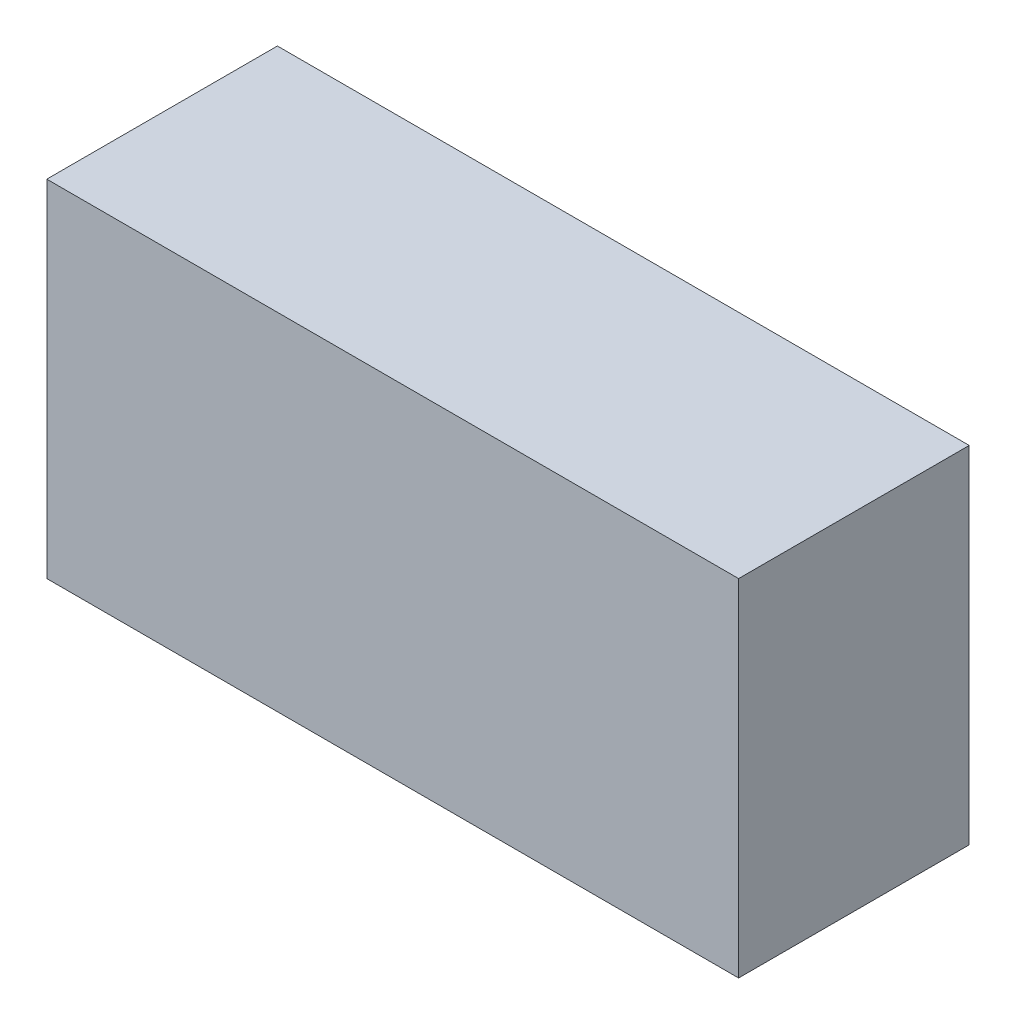
ISO-10303-21;
HEADER;
FILE_DESCRIPTION(('STEP AP214'),'2;1');
FILE_NAME('part.step','',(''),(''),'','','');
FILE_SCHEMA(('AUTOMOTIVE_DESIGN { 1 0 10303 214 1 1 1 1 }'));
ENDSEC;
DATA;
#1=APPLICATION_CONTEXT('core data for automotive mechanical design processes');
#2=APPLICATION_PROTOCOL_DEFINITION('international standard','automotive_design',2000,#1);
#3=PRODUCT_CONTEXT('',#1,'mechanical');
#4=PRODUCT('Part','Part','',(#3));
#5=PRODUCT_RELATED_PRODUCT_CATEGORY('part','',(#4));
#6=PRODUCT_DEFINITION_FORMATION('','',#4);
#7=PRODUCT_DEFINITION_CONTEXT('part definition',#1,'design');
#8=PRODUCT_DEFINITION('design','',#6,#7);
#9=PRODUCT_DEFINITION_SHAPE('','',#8);
#10=(LENGTH_UNIT() NAMED_UNIT(*) SI_UNIT(.MILLI.,.METRE.));
#11=(NAMED_UNIT(*) PLANE_ANGLE_UNIT() SI_UNIT($,.RADIAN.));
#12=(NAMED_UNIT(*) SI_UNIT($,.STERADIAN.) SOLID_ANGLE_UNIT());
#13=UNCERTAINTY_MEASURE_WITH_UNIT(LENGTH_MEASURE(1.E-05),#10,'distance_accuracy_value','');
#14=(GEOMETRIC_REPRESENTATION_CONTEXT(3) GLOBAL_UNCERTAINTY_ASSIGNED_CONTEXT((#13)) GLOBAL_UNIT_ASSIGNED_CONTEXT((#10,
#11,#12)) REPRESENTATION_CONTEXT('',''));
#15=CARTESIAN_POINT('',(0.,0.,0.));
#16=DIRECTION('',(0.,0.,1.));
#17=DIRECTION('',(1.,0.,0.));
#18=AXIS2_PLACEMENT_3D('',#15,#16,#17);
#19=CARTESIAN_POINT('',(-27.7611940298508,64.2537313432835,20.));
#20=DIRECTION('',(1.,0.,0.));
#21=DIRECTION('',(0.,1.,0.));
#22=AXIS2_PLACEMENT_3D('',#19,#20,#21);
#23=PLANE('',#22);
#24=DIRECTION('',(0.,-1.,0.));
#25=VECTOR('',#24,1.);
#26=CARTESIAN_POINT('',(-27.7611940298508,64.2537313432835,0.));
#27=LINE('',#26,#25);
#28=CARTESIAN_POINT('',(-27.7611940298508,64.2537313432835,0.));
#29=VERTEX_POINT('',#28);
#30=CARTESIAN_POINT('',(-27.7611940298508,34.2537313432835,0.));
#31=VERTEX_POINT('',#30);
#32=EDGE_CURVE('E96',#29,#31,#27,.T.);
#33=ORIENTED_EDGE('',*,*,#32,.T.);
#34=DIRECTION('',(0.,0.,-1.));
#35=VECTOR('',#34,1.);
#36=CARTESIAN_POINT('',(-27.7611940298508,34.2537313432835,20.));
#37=LINE('',#36,#35);
#38=CARTESIAN_POINT('',(-27.7611940298508,34.2537313432835,20.));
#39=VERTEX_POINT('',#38);
#40=EDGE_CURVE('E11',#39,#31,#37,.T.);
#41=ORIENTED_EDGE('',*,*,#40,.F.);
#42=DIRECTION('',(0.,-1.,0.));
#43=VECTOR('',#42,1.);
#44=CARTESIAN_POINT('',(-27.7611940298508,64.2537313432835,20.));
#45=LINE('',#44,#43);
#46=CARTESIAN_POINT('',(-27.7611940298508,64.2537313432835,20.));
#47=VERTEX_POINT('',#46);
#48=EDGE_CURVE('E82',#47,#39,#45,.T.);
#49=ORIENTED_EDGE('',*,*,#48,.F.);
#50=DIRECTION('',(0.,0.,-1.));
#51=VECTOR('',#50,1.);
#52=CARTESIAN_POINT('',(-27.7611940298508,64.2537313432835,20.));
#53=LINE('',#52,#51);
#54=EDGE_CURVE('E49',#47,#29,#53,.T.);
#55=ORIENTED_EDGE('',*,*,#54,.T.);
#56=EDGE_LOOP('',(#33,#41,#49,#55));
#57=FACE_BOUND('',#56,.T.);
#58=ADVANCED_FACE('F33',(#57),#23,.F.);
#59=CARTESIAN_POINT('',(-27.7611940298508,34.2537313432835,20.));
#60=DIRECTION('',(0.,1.,0.));
#61=DIRECTION('',(0.,0.,1.));
#62=AXIS2_PLACEMENT_3D('',#59,#60,#61);
#63=PLANE('',#62);
#64=DIRECTION('',(1.,0.,0.));
#65=VECTOR('',#64,1.);
#66=CARTESIAN_POINT('',(-27.7611940298508,34.2537313432835,0.));
#67=LINE('',#66,#65);
#68=CARTESIAN_POINT('',(32.2388059701492,34.2537313432835,0.));
#69=VERTEX_POINT('',#68);
#70=EDGE_CURVE('E87',#31,#69,#67,.T.);
#71=ORIENTED_EDGE('',*,*,#70,.T.);
#72=DIRECTION('',(0.,0.,-1.));
#73=VECTOR('',#72,1.);
#74=CARTESIAN_POINT('',(32.2388059701492,34.2537313432835,20.));
#75=LINE('',#74,#73);
#76=CARTESIAN_POINT('',(32.2388059701492,34.2537313432835,20.));
#77=VERTEX_POINT('',#76);
#78=EDGE_CURVE('E41',#77,#69,#75,.T.);
#79=ORIENTED_EDGE('',*,*,#78,.F.);
#80=DIRECTION('',(1.,0.,0.));
#81=VECTOR('',#80,1.);
#82=CARTESIAN_POINT('',(-27.7611940298508,34.2537313432835,20.));
#83=LINE('',#82,#81);
#84=EDGE_CURVE('E74',#39,#77,#83,.T.);
#85=ORIENTED_EDGE('',*,*,#84,.F.);
#86=ORIENTED_EDGE('',*,*,#40,.T.);
#87=EDGE_LOOP('',(#71,#79,#85,#86));
#88=FACE_BOUND('',#87,.T.);
#89=ADVANCED_FACE('F86',(#88),#63,.F.);
#90=CARTESIAN_POINT('',(32.2388059701492,64.2537313432835,20.));
#91=DIRECTION('',(1.,0.,0.));
#92=DIRECTION('',(0.,1.,0.));
#93=AXIS2_PLACEMENT_3D('',#90,#91,#92);
#94=PLANE('',#93);
#95=DIRECTION('',(0.,-1.,0.));
#96=VECTOR('',#95,1.);
#97=CARTESIAN_POINT('',(32.2388059701492,64.2537313432835,0.));
#98=LINE('',#97,#96);
#99=CARTESIAN_POINT('',(32.2388059701492,64.2537313432835,0.));
#100=VERTEX_POINT('',#99);
#101=EDGE_CURVE('E99',#100,#69,#98,.T.);
#102=ORIENTED_EDGE('',*,*,#101,.F.);
#103=DIRECTION('',(0.,0.,-1.));
#104=VECTOR('',#103,1.);
#105=CARTESIAN_POINT('',(32.2388059701492,64.2537313432835,20.));
#106=LINE('',#105,#104);
#107=CARTESIAN_POINT('',(32.2388059701492,64.2537313432835,20.));
#108=VERTEX_POINT('',#107);
#109=EDGE_CURVE('E63',#108,#100,#106,.T.);
#110=ORIENTED_EDGE('',*,*,#109,.F.);
#111=DIRECTION('',(0.,-1.,0.));
#112=VECTOR('',#111,1.);
#113=CARTESIAN_POINT('',(32.2388059701492,64.2537313432835,20.));
#114=LINE('',#113,#112);
#115=EDGE_CURVE('E81',#108,#77,#114,.T.);
#116=ORIENTED_EDGE('',*,*,#115,.T.);
#117=ORIENTED_EDGE('',*,*,#78,.T.);
#118=EDGE_LOOP('',(#102,#110,#116,#117));
#119=FACE_BOUND('',#118,.T.);
#120=ADVANCED_FACE('F90',(#119),#94,.T.);
#121=CARTESIAN_POINT('',(-27.7611940298508,64.2537313432835,20.));
#122=DIRECTION('',(0.,1.,0.));
#123=DIRECTION('',(0.,0.,1.));
#124=AXIS2_PLACEMENT_3D('',#121,#122,#123);
#125=PLANE('',#124);
#126=DIRECTION('',(1.,0.,0.));
#127=VECTOR('',#126,1.);
#128=CARTESIAN_POINT('',(-27.7611940298508,64.2537313432835,0.));
#129=LINE('',#128,#127);
#130=EDGE_CURVE('E101',#29,#100,#129,.T.);
#131=ORIENTED_EDGE('',*,*,#130,.F.);
#132=ORIENTED_EDGE('',*,*,#54,.F.);
#133=DIRECTION('',(1.,0.,0.));
#134=VECTOR('',#133,1.);
#135=CARTESIAN_POINT('',(-27.7611940298508,64.2537313432835,20.));
#136=LINE('',#135,#134);
#137=EDGE_CURVE('E91',#47,#108,#136,.T.);
#138=ORIENTED_EDGE('',*,*,#137,.T.);
#139=ORIENTED_EDGE('',*,*,#109,.T.);
#140=EDGE_LOOP('',(#131,#132,#138,#139));
#141=FACE_BOUND('',#140,.T.);
#142=ADVANCED_FACE('F107',(#141),#125,.T.);
#143=CARTESIAN_POINT('',(0.,0.,20.));
#144=DIRECTION('',(0.,0.,1.));
#145=DIRECTION('',(1.,0.,0.));
#146=AXIS2_PLACEMENT_3D('',#143,#144,#145);
#147=PLANE('',#146);
#148=ORIENTED_EDGE('',*,*,#48,.T.);
#149=ORIENTED_EDGE('',*,*,#84,.T.);
#150=ORIENTED_EDGE('',*,*,#115,.F.);
#151=ORIENTED_EDGE('',*,*,#137,.F.);
#152=EDGE_LOOP('',(#148,#149,#150,#151));
#153=FACE_BOUND('',#152,.T.);
#154=ADVANCED_FACE('F78',(#153),#147,.T.);
#155=CARTESIAN_POINT('',(0.,0.,0.));
#156=DIRECTION('',(0.,0.,1.));
#157=DIRECTION('',(1.,0.,0.));
#158=AXIS2_PLACEMENT_3D('',#155,#156,#157);
#159=PLANE('',#158);
#160=ORIENTED_EDGE('',*,*,#32,.F.);
#161=ORIENTED_EDGE('',*,*,#130,.T.);
#162=ORIENTED_EDGE('',*,*,#101,.T.);
#163=ORIENTED_EDGE('',*,*,#70,.F.);
#164=EDGE_LOOP('',(#160,#161,#162,#163));
#165=FACE_BOUND('',#164,.T.);
#166=ADVANCED_FACE('F106',(#165),#159,.F.);
#167=CLOSED_SHELL('',(#58,#89,#120,#142,#154,#166));
#168=MANIFOLD_SOLID_BREP('B2',#167);
#169=ADVANCED_BREP_SHAPE_REPRESENTATION('',(#18,#168),#14);
#170=SHAPE_DEFINITION_REPRESENTATION(#9,#169);
ENDSEC;
END-ISO-10303-21;
